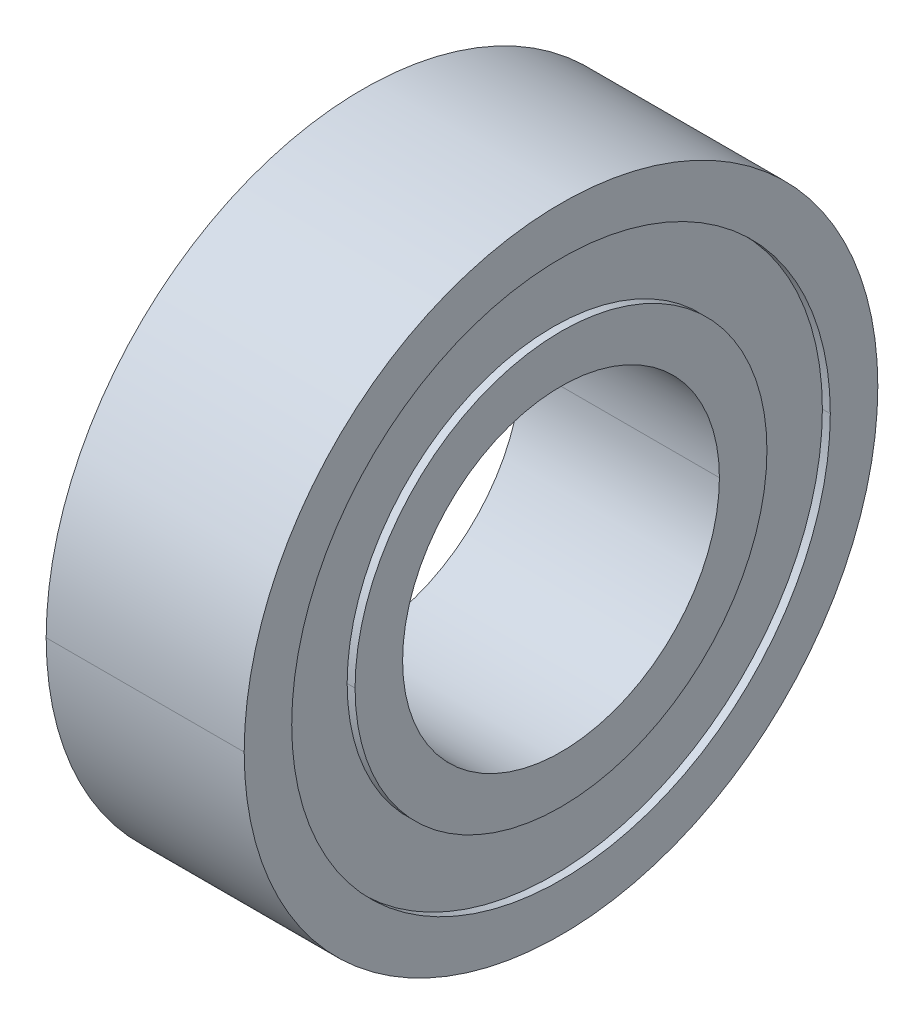
ISO-10303-21;
HEADER;
FILE_DESCRIPTION(('STEP AP214'),'2;1');
FILE_NAME('part.step','',(''),(''),'','','');
FILE_SCHEMA(('AUTOMOTIVE_DESIGN { 1 0 10303 214 1 1 1 1 }'));
ENDSEC;
DATA;
#1=APPLICATION_CONTEXT('core data for automotive mechanical design processes');
#2=APPLICATION_PROTOCOL_DEFINITION('international standard','automotive_design',2000,#1);
#3=PRODUCT_CONTEXT('',#1,'mechanical');
#4=PRODUCT('Part','Part','',(#3));
#5=PRODUCT_RELATED_PRODUCT_CATEGORY('part','',(#4));
#6=PRODUCT_DEFINITION_FORMATION('','',#4);
#7=PRODUCT_DEFINITION_CONTEXT('part definition',#1,'design');
#8=PRODUCT_DEFINITION('design','',#6,#7);
#9=PRODUCT_DEFINITION_SHAPE('','',#8);
#10=(LENGTH_UNIT() NAMED_UNIT(*) SI_UNIT(.MILLI.,.METRE.));
#11=(NAMED_UNIT(*) PLANE_ANGLE_UNIT() SI_UNIT($,.RADIAN.));
#12=(NAMED_UNIT(*) SI_UNIT($,.STERADIAN.) SOLID_ANGLE_UNIT());
#13=UNCERTAINTY_MEASURE_WITH_UNIT(LENGTH_MEASURE(1.E-05),#10,'distance_accuracy_value','');
#14=(GEOMETRIC_REPRESENTATION_CONTEXT(3) GLOBAL_UNCERTAINTY_ASSIGNED_CONTEXT((#13)) GLOBAL_UNIT_ASSIGNED_CONTEXT((#10,
#11,#12)) REPRESENTATION_CONTEXT('',''));
#15=CARTESIAN_POINT('',(0.,0.,0.));
#16=DIRECTION('',(0.,0.,1.));
#17=DIRECTION('',(1.,0.,0.));
#18=AXIS2_PLACEMENT_3D('',#15,#16,#17);
#19=CARTESIAN_POINT('',(0.,0.,0.));
#20=DIRECTION('',(-1.,0.,0.));
#21=DIRECTION('',(0.,0.,1.));
#22=AXIS2_PLACEMENT_3D('',#19,#20,#21);
#23=CYLINDRICAL_SURFACE('',#22,5.2);
#24=DIRECTION('',(-1.,0.,0.));
#25=VECTOR('',#24,1.);
#26=CARTESIAN_POINT('',(0.,0.,-5.2));
#27=LINE('',#26,#25);
#28=CARTESIAN_POINT('',(-2.3,0.,-5.2));
#29=VERTEX_POINT('',#28);
#30=CARTESIAN_POINT('',(-2.5,0.,-5.2));
#31=VERTEX_POINT('',#30);
#32=EDGE_CURVE('E178',#29,#31,#27,.T.);
#33=ORIENTED_EDGE('',*,*,#32,.F.);
#34=CARTESIAN_POINT('',(-2.3,0.,0.));
#35=DIRECTION('',(-1.,0.,0.));
#36=DIRECTION('',(0.,0.,1.));
#37=AXIS2_PLACEMENT_3D('',#34,#35,#36);
#38=CIRCLE('',#37,5.2);
#39=CARTESIAN_POINT('',(-2.3,0.,5.2));
#40=VERTEX_POINT('',#39);
#41=EDGE_CURVE('E11',#29,#40,#38,.T.);
#42=ORIENTED_EDGE('',*,*,#41,.T.);
#43=DIRECTION('',(-1.,0.,0.));
#44=VECTOR('',#43,1.);
#45=CARTESIAN_POINT('',(0.,0.,5.2));
#46=LINE('',#45,#44);
#47=CARTESIAN_POINT('',(-2.5,0.,5.2));
#48=VERTEX_POINT('',#47);
#49=EDGE_CURVE('E210',#40,#48,#46,.T.);
#50=ORIENTED_EDGE('',*,*,#49,.T.);
#51=CARTESIAN_POINT('',(-2.5,0.,0.));
#52=DIRECTION('',(-1.,0.,0.));
#53=DIRECTION('',(0.,0.,1.));
#54=AXIS2_PLACEMENT_3D('',#51,#52,#53);
#55=CIRCLE('',#54,5.2);
#56=EDGE_CURVE('E231',#31,#48,#55,.T.);
#57=ORIENTED_EDGE('',*,*,#56,.F.);
#58=EDGE_LOOP('',(#33,#42,#50,#57));
#59=FACE_BOUND('',#58,.T.);
#60=ADVANCED_FACE('F16',(#59),#23,.T.);
#61=CARTESIAN_POINT('',(-2.3,5.2,0.));
#62=DIRECTION('',(1.,0.,0.));
#63=DIRECTION('',(0.,1.,0.));
#64=AXIS2_PLACEMENT_3D('',#61,#62,#63);
#65=PLANE('',#64);
#66=CARTESIAN_POINT('',(-2.3,0.,0.));
#67=DIRECTION('',(-1.,0.,0.));
#68=DIRECTION('',(0.,0.,1.));
#69=AXIS2_PLACEMENT_3D('',#66,#67,#68);
#70=CIRCLE('',#69,5.2);
#71=EDGE_CURVE('E174',#40,#29,#70,.T.);
#72=ORIENTED_EDGE('',*,*,#71,.F.);
#73=ORIENTED_EDGE('',*,*,#41,.F.);
#74=EDGE_LOOP('',(#72,#73));
#75=FACE_BOUND('',#74,.T.);
#76=CARTESIAN_POINT('',(-2.3,0.,0.));
#77=DIRECTION('',(-1.,0.,0.));
#78=DIRECTION('',(0.,0.,1.));
#79=AXIS2_PLACEMENT_3D('',#76,#77,#78);
#80=CIRCLE('',#79,6.8);
#81=CARTESIAN_POINT('',(-2.3,0.,6.8));
#82=VERTEX_POINT('',#81);
#83=CARTESIAN_POINT('',(-2.3,0.,-6.8));
#84=VERTEX_POINT('',#83);
#85=EDGE_CURVE('E27',#82,#84,#80,.T.);
#86=ORIENTED_EDGE('',*,*,#85,.T.);
#87=CARTESIAN_POINT('',(-2.3,0.,0.));
#88=DIRECTION('',(-1.,0.,0.));
#89=DIRECTION('',(0.,0.,1.));
#90=AXIS2_PLACEMENT_3D('',#87,#88,#89);
#91=CIRCLE('',#90,6.8);
#92=EDGE_CURVE('E266',#84,#82,#91,.T.);
#93=ORIENTED_EDGE('',*,*,#92,.T.);
#94=EDGE_LOOP('',(#86,#93));
#95=FACE_BOUND('',#94,.T.);
#96=ADVANCED_FACE('F300',(#75,#95),#65,.F.);
#97=CARTESIAN_POINT('',(0.,0.,0.));
#98=DIRECTION('',(-1.,0.,0.));
#99=DIRECTION('',(0.,0.,1.));
#100=AXIS2_PLACEMENT_3D('',#97,#98,#99);
#101=CYLINDRICAL_SURFACE('',#100,6.8);
#102=DIRECTION('',(-1.,0.,0.));
#103=VECTOR('',#102,1.);
#104=CARTESIAN_POINT('',(0.,0.,-6.8));
#105=LINE('',#104,#103);
#106=CARTESIAN_POINT('',(-2.5,0.,-6.8));
#107=VERTEX_POINT('',#106);
#108=EDGE_CURVE('E214',#84,#107,#105,.T.);
#109=ORIENTED_EDGE('',*,*,#108,.F.);
#110=ORIENTED_EDGE('',*,*,#85,.F.);
#111=DIRECTION('',(-1.,0.,0.));
#112=VECTOR('',#111,1.);
#113=CARTESIAN_POINT('',(0.,0.,6.8));
#114=LINE('',#113,#112);
#115=CARTESIAN_POINT('',(-2.5,0.,6.8));
#116=VERTEX_POINT('',#115);
#117=EDGE_CURVE('E168',#82,#116,#114,.T.);
#118=ORIENTED_EDGE('',*,*,#117,.T.);
#119=CARTESIAN_POINT('',(-2.5,0.,0.));
#120=DIRECTION('',(-1.,0.,0.));
#121=DIRECTION('',(0.,0.,1.));
#122=AXIS2_PLACEMENT_3D('',#119,#120,#121);
#123=CIRCLE('',#122,6.8);
#124=EDGE_CURVE('E184',#116,#107,#123,.T.);
#125=ORIENTED_EDGE('',*,*,#124,.T.);
#126=EDGE_LOOP('',(#109,#110,#118,#125));
#127=FACE_BOUND('',#126,.T.);
#128=ADVANCED_FACE('F18',(#127),#101,.F.);
#129=CARTESIAN_POINT('',(-2.5,8.,0.));
#130=DIRECTION('',(1.,0.,0.));
#131=DIRECTION('',(0.,1.,0.));
#132=AXIS2_PLACEMENT_3D('',#129,#130,#131);
#133=PLANE('',#132);
#134=ORIENTED_EDGE('',*,*,#124,.F.);
#135=CARTESIAN_POINT('',(-2.5,0.,0.));
#136=DIRECTION('',(-1.,0.,0.));
#137=DIRECTION('',(0.,0.,1.));
#138=AXIS2_PLACEMENT_3D('',#135,#136,#137);
#139=CIRCLE('',#138,6.8);
#140=EDGE_CURVE('E173',#107,#116,#139,.T.);
#141=ORIENTED_EDGE('',*,*,#140,.F.);
#142=EDGE_LOOP('',(#134,#141));
#143=FACE_BOUND('',#142,.T.);
#144=CARTESIAN_POINT('',(-2.5,0.,0.));
#145=DIRECTION('',(-1.,0.,0.));
#146=DIRECTION('',(0.,0.,1.));
#147=AXIS2_PLACEMENT_3D('',#144,#145,#146);
#148=CIRCLE('',#147,8.);
#149=CARTESIAN_POINT('',(-2.5,0.,8.));
#150=VERTEX_POINT('',#149);
#151=CARTESIAN_POINT('',(-2.5,0.,-8.));
#152=VERTEX_POINT('',#151);
#153=EDGE_CURVE('E163',#150,#152,#148,.T.);
#154=ORIENTED_EDGE('',*,*,#153,.T.);
#155=CARTESIAN_POINT('',(-2.5,0.,0.));
#156=DIRECTION('',(-1.,0.,0.));
#157=DIRECTION('',(0.,0.,1.));
#158=AXIS2_PLACEMENT_3D('',#155,#156,#157);
#159=CIRCLE('',#158,8.);
#160=EDGE_CURVE('E236',#152,#150,#159,.T.);
#161=ORIENTED_EDGE('',*,*,#160,.T.);
#162=EDGE_LOOP('',(#154,#161));
#163=FACE_BOUND('',#162,.T.);
#164=ADVANCED_FACE('F314',(#143,#163),#133,.F.);
#165=CARTESIAN_POINT('',(0.,0.,0.));
#166=DIRECTION('',(-1.,0.,0.));
#167=DIRECTION('',(0.,0.,1.));
#168=AXIS2_PLACEMENT_3D('',#165,#166,#167);
#169=CYLINDRICAL_SURFACE('',#168,8.);
#170=DIRECTION('',(-1.,0.,0.));
#171=VECTOR('',#170,1.);
#172=CARTESIAN_POINT('',(0.,0.,-8.));
#173=LINE('',#172,#171);
#174=CARTESIAN_POINT('',(2.5,0.,-8.));
#175=VERTEX_POINT('',#174);
#176=EDGE_CURVE('E187',#175,#152,#173,.T.);
#177=ORIENTED_EDGE('',*,*,#176,.F.);
#178=CARTESIAN_POINT('',(2.5,0.,0.));
#179=DIRECTION('',(-1.,0.,0.));
#180=DIRECTION('',(0.,0.,1.));
#181=AXIS2_PLACEMENT_3D('',#178,#179,#180);
#182=CIRCLE('',#181,8.);
#183=CARTESIAN_POINT('',(2.5,0.,8.));
#184=VERTEX_POINT('',#183);
#185=EDGE_CURVE('E141',#175,#184,#182,.T.);
#186=ORIENTED_EDGE('',*,*,#185,.T.);
#187=DIRECTION('',(-1.,0.,0.));
#188=VECTOR('',#187,1.);
#189=CARTESIAN_POINT('',(0.,0.,8.));
#190=LINE('',#189,#188);
#191=EDGE_CURVE('E156',#184,#150,#190,.T.);
#192=ORIENTED_EDGE('',*,*,#191,.T.);
#193=ORIENTED_EDGE('',*,*,#160,.F.);
#194=EDGE_LOOP('',(#177,#186,#192,#193));
#195=FACE_BOUND('',#194,.T.);
#196=ADVANCED_FACE('F317',(#195),#169,.T.);
#197=CARTESIAN_POINT('',(2.5,6.8,0.));
#198=DIRECTION('',(-1.,0.,0.));
#199=DIRECTION('',(0.,0.,1.));
#200=AXIS2_PLACEMENT_3D('',#197,#198,#199);
#201=PLANE('',#200);
#202=CARTESIAN_POINT('',(2.5,0.,0.));
#203=DIRECTION('',(-1.,0.,0.));
#204=DIRECTION('',(0.,0.,1.));
#205=AXIS2_PLACEMENT_3D('',#202,#203,#204);
#206=CIRCLE('',#205,6.8);
#207=CARTESIAN_POINT('',(2.5,0.,6.8));
#208=VERTEX_POINT('',#207);
#209=CARTESIAN_POINT('',(2.5,0.,-6.8));
#210=VERTEX_POINT('',#209);
#211=EDGE_CURVE('E131',#208,#210,#206,.T.);
#212=ORIENTED_EDGE('',*,*,#211,.T.);
#213=CARTESIAN_POINT('',(2.5,0.,0.));
#214=DIRECTION('',(-1.,0.,0.));
#215=DIRECTION('',(0.,0.,1.));
#216=AXIS2_PLACEMENT_3D('',#213,#214,#215);
#217=CIRCLE('',#216,6.8);
#218=EDGE_CURVE('E136',#210,#208,#217,.T.);
#219=ORIENTED_EDGE('',*,*,#218,.T.);
#220=EDGE_LOOP('',(#212,#219));
#221=FACE_BOUND('',#220,.T.);
#222=CARTESIAN_POINT('',(2.5,0.,0.));
#223=DIRECTION('',(-1.,0.,0.));
#224=DIRECTION('',(0.,0.,1.));
#225=AXIS2_PLACEMENT_3D('',#222,#223,#224);
#226=CIRCLE('',#225,8.);
#227=EDGE_CURVE('E172',#184,#175,#226,.T.);
#228=ORIENTED_EDGE('',*,*,#227,.F.);
#229=ORIENTED_EDGE('',*,*,#185,.F.);
#230=EDGE_LOOP('',(#228,#229));
#231=FACE_BOUND('',#230,.T.);
#232=ADVANCED_FACE('F133',(#221,#231),#201,.F.);
#233=CARTESIAN_POINT('',(0.,0.,0.));
#234=DIRECTION('',(-1.,0.,0.));
#235=DIRECTION('',(0.,0.,1.));
#236=AXIS2_PLACEMENT_3D('',#233,#234,#235);
#237=CYLINDRICAL_SURFACE('',#236,6.8);
#238=DIRECTION('',(-1.,0.,0.));
#239=VECTOR('',#238,1.);
#240=CARTESIAN_POINT('',(0.,0.,-6.8));
#241=LINE('',#240,#239);
#242=CARTESIAN_POINT('',(2.3,0.,-6.8));
#243=VERTEX_POINT('',#242);
#244=EDGE_CURVE('E145',#210,#243,#241,.T.);
#245=ORIENTED_EDGE('',*,*,#244,.F.);
#246=ORIENTED_EDGE('',*,*,#211,.F.);
#247=DIRECTION('',(-1.,0.,0.));
#248=VECTOR('',#247,1.);
#249=CARTESIAN_POINT('',(0.,0.,6.8));
#250=LINE('',#249,#248);
#251=CARTESIAN_POINT('',(2.3,0.,6.8));
#252=VERTEX_POINT('',#251);
#253=EDGE_CURVE('E154',#208,#252,#250,.T.);
#254=ORIENTED_EDGE('',*,*,#253,.T.);
#255=CARTESIAN_POINT('',(2.3,0.,0.));
#256=DIRECTION('',(-1.,0.,0.));
#257=DIRECTION('',(0.,0.,1.));
#258=AXIS2_PLACEMENT_3D('',#255,#256,#257);
#259=CIRCLE('',#258,6.8);
#260=EDGE_CURVE('E142',#252,#243,#259,.T.);
#261=ORIENTED_EDGE('',*,*,#260,.T.);
#262=EDGE_LOOP('',(#245,#246,#254,#261));
#263=FACE_BOUND('',#262,.T.);
#264=ADVANCED_FACE('F146',(#263),#237,.F.);
#265=CARTESIAN_POINT('',(2.3,6.8,0.));
#266=DIRECTION('',(-1.,0.,0.));
#267=DIRECTION('',(0.,0.,1.));
#268=AXIS2_PLACEMENT_3D('',#265,#266,#267);
#269=PLANE('',#268);
#270=CARTESIAN_POINT('',(2.3,0.,0.));
#271=DIRECTION('',(-1.,0.,0.));
#272=DIRECTION('',(0.,0.,1.));
#273=AXIS2_PLACEMENT_3D('',#270,#271,#272);
#274=CIRCLE('',#273,5.2);
#275=CARTESIAN_POINT('',(2.3,0.,5.2));
#276=VERTEX_POINT('',#275);
#277=CARTESIAN_POINT('',(2.3,0.,-5.2));
#278=VERTEX_POINT('',#277);
#279=EDGE_CURVE('E20',#276,#278,#274,.T.);
#280=ORIENTED_EDGE('',*,*,#279,.T.);
#281=CARTESIAN_POINT('',(2.3,0.,0.));
#282=DIRECTION('',(-1.,0.,0.));
#283=DIRECTION('',(0.,0.,1.));
#284=AXIS2_PLACEMENT_3D('',#281,#282,#283);
#285=CIRCLE('',#284,5.2);
#286=EDGE_CURVE('E216',#278,#276,#285,.T.);
#287=ORIENTED_EDGE('',*,*,#286,.T.);
#288=EDGE_LOOP('',(#280,#287));
#289=FACE_BOUND('',#288,.T.);
#290=ORIENTED_EDGE('',*,*,#260,.F.);
#291=CARTESIAN_POINT('',(2.3,0.,0.));
#292=DIRECTION('',(-1.,0.,0.));
#293=DIRECTION('',(0.,0.,1.));
#294=AXIS2_PLACEMENT_3D('',#291,#292,#293);
#295=CIRCLE('',#294,6.8);
#296=EDGE_CURVE('E151',#243,#252,#295,.T.);
#297=ORIENTED_EDGE('',*,*,#296,.F.);
#298=EDGE_LOOP('',(#290,#297));
#299=FACE_BOUND('',#298,.T.);
#300=ADVANCED_FACE('F335',(#289,#299),#269,.F.);
#301=CARTESIAN_POINT('',(0.,0.,0.));
#302=DIRECTION('',(-1.,0.,0.));
#303=DIRECTION('',(0.,0.,1.));
#304=AXIS2_PLACEMENT_3D('',#301,#302,#303);
#305=CYLINDRICAL_SURFACE('',#304,5.2);
#306=DIRECTION('',(-1.,0.,0.));
#307=VECTOR('',#306,1.);
#308=CARTESIAN_POINT('',(0.,0.,-5.2));
#309=LINE('',#308,#307);
#310=CARTESIAN_POINT('',(2.5,0.,-5.2));
#311=VERTEX_POINT('',#310);
#312=EDGE_CURVE('E241',#311,#278,#309,.T.);
#313=ORIENTED_EDGE('',*,*,#312,.F.);
#314=CARTESIAN_POINT('',(2.5,0.,0.));
#315=DIRECTION('',(-1.,0.,0.));
#316=DIRECTION('',(0.,0.,1.));
#317=AXIS2_PLACEMENT_3D('',#314,#315,#316);
#318=CIRCLE('',#317,5.2);
#319=CARTESIAN_POINT('',(2.5,0.,5.2));
#320=VERTEX_POINT('',#319);
#321=EDGE_CURVE('E182',#311,#320,#318,.T.);
#322=ORIENTED_EDGE('',*,*,#321,.T.);
#323=DIRECTION('',(-1.,0.,0.));
#324=VECTOR('',#323,1.);
#325=CARTESIAN_POINT('',(0.,0.,5.2));
#326=LINE('',#325,#324);
#327=EDGE_CURVE('E230',#320,#276,#326,.T.);
#328=ORIENTED_EDGE('',*,*,#327,.T.);
#329=ORIENTED_EDGE('',*,*,#286,.F.);
#330=EDGE_LOOP('',(#313,#322,#328,#329));
#331=FACE_BOUND('',#330,.T.);
#332=ADVANCED_FACE('F336',(#331),#305,.T.);
#333=CARTESIAN_POINT('',(2.5,4.,0.));
#334=DIRECTION('',(-1.,0.,0.));
#335=DIRECTION('',(0.,0.,1.));
#336=AXIS2_PLACEMENT_3D('',#333,#334,#335);
#337=PLANE('',#336);
#338=CARTESIAN_POINT('',(2.5,0.,0.));
#339=DIRECTION('',(-1.,0.,0.));
#340=DIRECTION('',(0.,0.,1.));
#341=AXIS2_PLACEMENT_3D('',#338,#339,#340);
#342=CIRCLE('',#341,4.);
#343=CARTESIAN_POINT('',(2.5,0.,4.));
#344=VERTEX_POINT('',#343);
#345=CARTESIAN_POINT('',(2.5,0.,-4.));
#346=VERTEX_POINT('',#345);
#347=EDGE_CURVE('E179',#344,#346,#342,.T.);
#348=ORIENTED_EDGE('',*,*,#347,.T.);
#349=CARTESIAN_POINT('',(2.5,0.,0.));
#350=DIRECTION('',(-1.,0.,0.));
#351=DIRECTION('',(0.,0.,1.));
#352=AXIS2_PLACEMENT_3D('',#349,#350,#351);
#353=CIRCLE('',#352,4.);
#354=EDGE_CURVE('E225',#346,#344,#353,.T.);
#355=ORIENTED_EDGE('',*,*,#354,.T.);
#356=EDGE_LOOP('',(#348,#355));
#357=FACE_BOUND('',#356,.T.);
#358=CARTESIAN_POINT('',(2.5,0.,0.));
#359=DIRECTION('',(-1.,0.,0.));
#360=DIRECTION('',(0.,0.,1.));
#361=AXIS2_PLACEMENT_3D('',#358,#359,#360);
#362=CIRCLE('',#361,5.2);
#363=EDGE_CURVE('E244',#320,#311,#362,.T.);
#364=ORIENTED_EDGE('',*,*,#363,.F.);
#365=ORIENTED_EDGE('',*,*,#321,.F.);
#366=EDGE_LOOP('',(#364,#365));
#367=FACE_BOUND('',#366,.T.);
#368=ADVANCED_FACE('F339',(#357,#367),#337,.F.);
#369=CARTESIAN_POINT('',(0.,0.,0.));
#370=DIRECTION('',(-1.,0.,0.));
#371=DIRECTION('',(0.,0.,1.));
#372=AXIS2_PLACEMENT_3D('',#369,#370,#371);
#373=CYLINDRICAL_SURFACE('',#372,4.);
#374=DIRECTION('',(-1.,0.,0.));
#375=VECTOR('',#374,1.);
#376=CARTESIAN_POINT('',(0.,0.,-4.));
#377=LINE('',#376,#375);
#378=CARTESIAN_POINT('',(-2.5,0.,-4.));
#379=VERTEX_POINT('',#378);
#380=EDGE_CURVE('E229',#346,#379,#377,.T.);
#381=ORIENTED_EDGE('',*,*,#380,.F.);
#382=ORIENTED_EDGE('',*,*,#347,.F.);
#383=DIRECTION('',(-1.,0.,0.));
#384=VECTOR('',#383,1.);
#385=CARTESIAN_POINT('',(0.,0.,4.));
#386=LINE('',#385,#384);
#387=CARTESIAN_POINT('',(-2.5,0.,4.));
#388=VERTEX_POINT('',#387);
#389=EDGE_CURVE('E234',#344,#388,#386,.T.);
#390=ORIENTED_EDGE('',*,*,#389,.T.);
#391=CARTESIAN_POINT('',(-2.5,0.,0.));
#392=DIRECTION('',(-1.,0.,0.));
#393=DIRECTION('',(0.,0.,1.));
#394=AXIS2_PLACEMENT_3D('',#391,#392,#393);
#395=CIRCLE('',#394,4.);
#396=EDGE_CURVE('E41',#388,#379,#395,.T.);
#397=ORIENTED_EDGE('',*,*,#396,.T.);
#398=EDGE_LOOP('',(#381,#382,#390,#397));
#399=FACE_BOUND('',#398,.T.);
#400=ADVANCED_FACE('F284',(#399),#373,.F.);
#401=CARTESIAN_POINT('',(-2.5,5.2,0.));
#402=DIRECTION('',(1.,0.,0.));
#403=DIRECTION('',(0.,1.,0.));
#404=AXIS2_PLACEMENT_3D('',#401,#402,#403);
#405=PLANE('',#404);
#406=ORIENTED_EDGE('',*,*,#396,.F.);
#407=CARTESIAN_POINT('',(-2.5,0.,0.));
#408=DIRECTION('',(-1.,0.,0.));
#409=DIRECTION('',(0.,0.,1.));
#410=AXIS2_PLACEMENT_3D('',#407,#408,#409);
#411=CIRCLE('',#410,4.);
#412=EDGE_CURVE('E273',#379,#388,#411,.T.);
#413=ORIENTED_EDGE('',*,*,#412,.F.);
#414=EDGE_LOOP('',(#406,#413));
#415=FACE_BOUND('',#414,.T.);
#416=CARTESIAN_POINT('',(-2.5,0.,0.));
#417=DIRECTION('',(-1.,0.,0.));
#418=DIRECTION('',(0.,0.,1.));
#419=AXIS2_PLACEMENT_3D('',#416,#417,#418);
#420=CIRCLE('',#419,5.2);
#421=EDGE_CURVE('E206',#48,#31,#420,.T.);
#422=ORIENTED_EDGE('',*,*,#421,.T.);
#423=ORIENTED_EDGE('',*,*,#56,.T.);
#424=EDGE_LOOP('',(#422,#423));
#425=FACE_BOUND('',#424,.T.);
#426=ADVANCED_FACE('F288',(#415,#425),#405,.F.);
#427=CARTESIAN_POINT('',(0.,0.,0.));
#428=DIRECTION('',(-1.,0.,0.));
#429=DIRECTION('',(0.,0.,1.));
#430=AXIS2_PLACEMENT_3D('',#427,#428,#429);
#431=CYLINDRICAL_SURFACE('',#430,4.);
#432=ORIENTED_EDGE('',*,*,#354,.F.);
#433=ORIENTED_EDGE('',*,*,#380,.T.);
#434=ORIENTED_EDGE('',*,*,#412,.T.);
#435=ORIENTED_EDGE('',*,*,#389,.F.);
#436=EDGE_LOOP('',(#432,#433,#434,#435));
#437=FACE_BOUND('',#436,.T.);
#438=ADVANCED_FACE('F287',(#437),#431,.F.);
#439=CARTESIAN_POINT('',(0.,0.,0.));
#440=DIRECTION('',(-1.,0.,0.));
#441=DIRECTION('',(0.,0.,1.));
#442=AXIS2_PLACEMENT_3D('',#439,#440,#441);
#443=CYLINDRICAL_SURFACE('',#442,5.2);
#444=ORIENTED_EDGE('',*,*,#363,.T.);
#445=ORIENTED_EDGE('',*,*,#312,.T.);
#446=ORIENTED_EDGE('',*,*,#279,.F.);
#447=ORIENTED_EDGE('',*,*,#327,.F.);
#448=EDGE_LOOP('',(#444,#445,#446,#447));
#449=FACE_BOUND('',#448,.T.);
#450=ADVANCED_FACE('F345',(#449),#443,.T.);
#451=CARTESIAN_POINT('',(0.,0.,0.));
#452=DIRECTION('',(-1.,0.,0.));
#453=DIRECTION('',(0.,0.,1.));
#454=AXIS2_PLACEMENT_3D('',#451,#452,#453);
#455=CYLINDRICAL_SURFACE('',#454,6.8);
#456=ORIENTED_EDGE('',*,*,#218,.F.);
#457=ORIENTED_EDGE('',*,*,#244,.T.);
#458=ORIENTED_EDGE('',*,*,#296,.T.);
#459=ORIENTED_EDGE('',*,*,#253,.F.);
#460=EDGE_LOOP('',(#456,#457,#458,#459));
#461=FACE_BOUND('',#460,.T.);
#462=ADVANCED_FACE('F153',(#461),#455,.F.);
#463=CARTESIAN_POINT('',(0.,0.,0.));
#464=DIRECTION('',(-1.,0.,0.));
#465=DIRECTION('',(0.,0.,1.));
#466=AXIS2_PLACEMENT_3D('',#463,#464,#465);
#467=CYLINDRICAL_SURFACE('',#466,8.);
#468=ORIENTED_EDGE('',*,*,#227,.T.);
#469=ORIENTED_EDGE('',*,*,#176,.T.);
#470=ORIENTED_EDGE('',*,*,#153,.F.);
#471=ORIENTED_EDGE('',*,*,#191,.F.);
#472=EDGE_LOOP('',(#468,#469,#470,#471));
#473=FACE_BOUND('',#472,.T.);
#474=ADVANCED_FACE('F318',(#473),#467,.T.);
#475=CARTESIAN_POINT('',(0.,0.,0.));
#476=DIRECTION('',(-1.,0.,0.));
#477=DIRECTION('',(0.,0.,1.));
#478=AXIS2_PLACEMENT_3D('',#475,#476,#477);
#479=CYLINDRICAL_SURFACE('',#478,6.8);
#480=ORIENTED_EDGE('',*,*,#92,.F.);
#481=ORIENTED_EDGE('',*,*,#108,.T.);
#482=ORIENTED_EDGE('',*,*,#140,.T.);
#483=ORIENTED_EDGE('',*,*,#117,.F.);
#484=EDGE_LOOP('',(#480,#481,#482,#483));
#485=FACE_BOUND('',#484,.T.);
#486=ADVANCED_FACE('F312',(#485),#479,.F.);
#487=CARTESIAN_POINT('',(0.,0.,0.));
#488=DIRECTION('',(-1.,0.,0.));
#489=DIRECTION('',(0.,0.,1.));
#490=AXIS2_PLACEMENT_3D('',#487,#488,#489);
#491=CYLINDRICAL_SURFACE('',#490,5.2);
#492=ORIENTED_EDGE('',*,*,#71,.T.);
#493=ORIENTED_EDGE('',*,*,#32,.T.);
#494=ORIENTED_EDGE('',*,*,#421,.F.);
#495=ORIENTED_EDGE('',*,*,#49,.F.);
#496=EDGE_LOOP('',(#492,#493,#494,#495));
#497=FACE_BOUND('',#496,.T.);
#498=ADVANCED_FACE('F296',(#497),#491,.T.);
#499=CLOSED_SHELL('',(#60,#96,#128,#164,#196,#232,#264,#300,#332,#368,#400,#426,#438,#450,#462,
#474,#486,#498));
#500=MANIFOLD_SOLID_BREP('B1',#499);
#501=ADVANCED_BREP_SHAPE_REPRESENTATION('',(#18,#500),#14);
#502=SHAPE_DEFINITION_REPRESENTATION(#9,#501);
ENDSEC;
END-ISO-10303-21;
